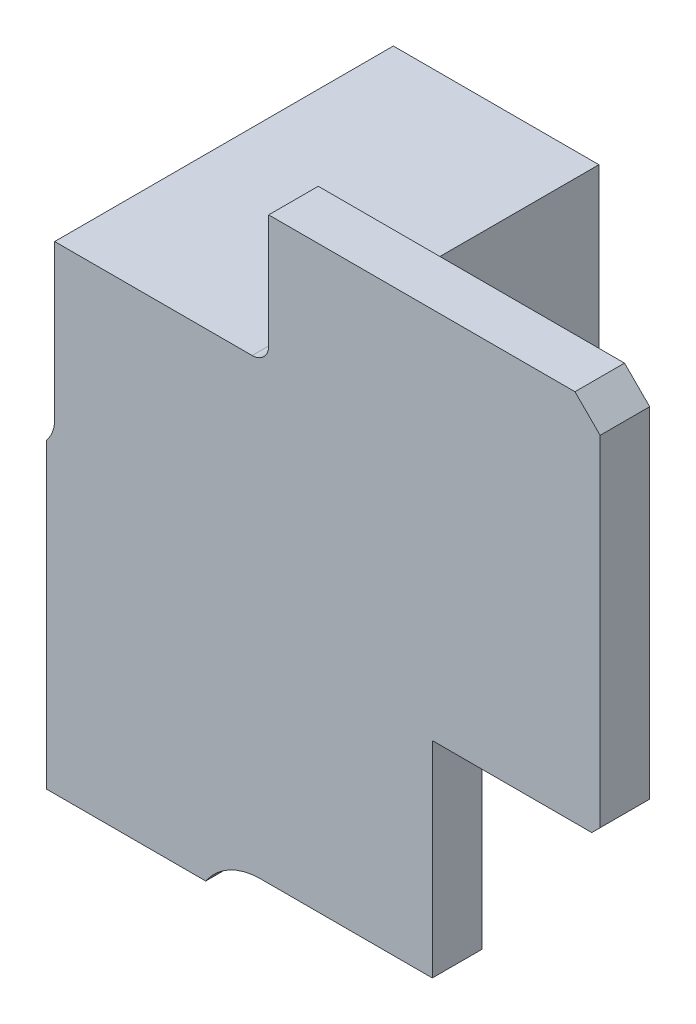
ISO-10303-21;
HEADER;
FILE_DESCRIPTION(('STEP AP214'),'2;1');
FILE_NAME('part.step','',(''),(''),'','','');
FILE_SCHEMA(('AUTOMOTIVE_DESIGN { 1 0 10303 214 1 1 1 1 }'));
ENDSEC;
DATA;
#1=APPLICATION_CONTEXT('core data for automotive mechanical design processes');
#2=APPLICATION_PROTOCOL_DEFINITION('international standard','automotive_design',2000,#1);
#3=PRODUCT_CONTEXT('',#1,'mechanical');
#4=PRODUCT('Part','Part','',(#3));
#5=PRODUCT_RELATED_PRODUCT_CATEGORY('part','',(#4));
#6=PRODUCT_DEFINITION_FORMATION('','',#4);
#7=PRODUCT_DEFINITION_CONTEXT('part definition',#1,'design');
#8=PRODUCT_DEFINITION('design','',#6,#7);
#9=PRODUCT_DEFINITION_SHAPE('','',#8);
#10=(LENGTH_UNIT() NAMED_UNIT(*) SI_UNIT(.MILLI.,.METRE.));
#11=(NAMED_UNIT(*) PLANE_ANGLE_UNIT() SI_UNIT($,.RADIAN.));
#12=(NAMED_UNIT(*) SI_UNIT($,.STERADIAN.) SOLID_ANGLE_UNIT());
#13=UNCERTAINTY_MEASURE_WITH_UNIT(LENGTH_MEASURE(1.E-05),#10,'distance_accuracy_value','');
#14=(GEOMETRIC_REPRESENTATION_CONTEXT(3) GLOBAL_UNCERTAINTY_ASSIGNED_CONTEXT((#13)) GLOBAL_UNIT_ASSIGNED_CONTEXT((#10,
#11,#12)) REPRESENTATION_CONTEXT('',''));
#15=CARTESIAN_POINT('',(0.,0.,0.));
#16=DIRECTION('',(0.,0.,1.));
#17=DIRECTION('',(1.,0.,0.));
#18=AXIS2_PLACEMENT_3D('',#15,#16,#17);
#19=CARTESIAN_POINT('',(0.,0.,0.));
#20=DIRECTION('',(0.,0.,1.));
#21=DIRECTION('',(1.,0.,0.));
#22=AXIS2_PLACEMENT_3D('',#19,#20,#21);
#23=PLANE('',#22);
#24=DIRECTION('',(1.,0.,0.));
#25=VECTOR('',#24,1.);
#26=CARTESIAN_POINT('',(0.,90.424,0.));
#27=LINE('',#26,#25);
#28=CARTESIAN_POINT('',(97.162789,90.424,0.));
#29=VERTEX_POINT('',#28);
#30=CARTESIAN_POINT('',(97.409,90.424,0.));
#31=VERTEX_POINT('',#30);
#32=EDGE_CURVE('E210',#29,#31,#27,.T.);
#33=ORIENTED_EDGE('',*,*,#32,.F.);
#34=CARTESIAN_POINT('',(97.162789,90.924211,0.));
#35=DIRECTION('',(0.,0.,1.));
#36=DIRECTION('',(1.,0.,0.));
#37=AXIS2_PLACEMENT_3D('',#34,#35,#36);
#38=CIRCLE('',#37,0.500211);
#39=CARTESIAN_POINT('',(97.663,90.924211,0.));
#40=VERTEX_POINT('',#39);
#41=EDGE_CURVE('E303',#40,#29,#38,.F.);
#42=ORIENTED_EDGE('',*,*,#41,.F.);
#43=DIRECTION('',(0.,1.,0.));
#44=VECTOR('',#43,1.);
#45=CARTESIAN_POINT('',(97.663,0.,0.));
#46=LINE('',#45,#44);
#47=CARTESIAN_POINT('',(97.663,94.361,0.));
#48=VERTEX_POINT('',#47);
#49=EDGE_CURVE('E252',#40,#48,#46,.T.);
#50=ORIENTED_EDGE('',*,*,#49,.T.);
#51=DIRECTION('',(1.,0.,0.));
#52=VECTOR('',#51,1.);
#53=CARTESIAN_POINT('',(0.,94.361,0.));
#54=LINE('',#53,#52);
#55=CARTESIAN_POINT('',(106.934,94.361,0.));
#56=VERTEX_POINT('',#55);
#57=EDGE_CURVE('E258',#48,#56,#54,.T.);
#58=ORIENTED_EDGE('',*,*,#57,.T.);
#59=DIRECTION('',(0.707106781186548,-0.707106781186548,0.));
#60=VECTOR('',#59,1.);
#61=CARTESIAN_POINT('',(100.6475,100.6475,0.));
#62=LINE('',#61,#60);
#63=CARTESIAN_POINT('',(107.696,93.599,0.));
#64=VERTEX_POINT('',#63);
#65=EDGE_CURVE('E332',#56,#64,#62,.T.);
#66=ORIENTED_EDGE('',*,*,#65,.T.);
#67=DIRECTION('',(0.,1.,0.));
#68=VECTOR('',#67,1.);
#69=CARTESIAN_POINT('',(107.696,0.,0.));
#70=LINE('',#69,#68);
#71=CARTESIAN_POINT('',(107.696,83.312,0.));
#72=VERTEX_POINT('',#71);
#73=EDGE_CURVE('E328',#72,#64,#70,.T.);
#74=ORIENTED_EDGE('',*,*,#73,.F.);
#75=DIRECTION('',(0.707106781186548,0.707106781186548,0.));
#76=VECTOR('',#75,1.);
#77=CARTESIAN_POINT('',(12.192,-12.192,0.));
#78=LINE('',#77,#76);
#79=CARTESIAN_POINT('',(107.442,83.058,0.));
#80=VERTEX_POINT('',#79);
#81=EDGE_CURVE('E325',#80,#72,#78,.T.);
#82=ORIENTED_EDGE('',*,*,#81,.F.);
#83=DIRECTION('',(1.,0.,0.));
#84=VECTOR('',#83,1.);
#85=CARTESIAN_POINT('',(0.,83.058,0.));
#86=LINE('',#85,#84);
#87=CARTESIAN_POINT('',(102.616,83.058,0.));
#88=VERTEX_POINT('',#87);
#89=EDGE_CURVE('E322',#88,#80,#86,.T.);
#90=ORIENTED_EDGE('',*,*,#89,.F.);
#91=DIRECTION('',(0.,-1.,0.));
#92=VECTOR('',#91,1.);
#93=CARTESIAN_POINT('',(102.616,-2.28788405074522E-13,0.));
#94=LINE('',#93,#92);
#95=CARTESIAN_POINT('',(102.616,76.8335452544773,0.));
#96=VERTEX_POINT('',#95);
#97=EDGE_CURVE('E318',#88,#96,#94,.T.);
#98=ORIENTED_EDGE('',*,*,#97,.T.);
#99=DIRECTION('',(1.,0.,0.));
#100=VECTOR('',#99,1.);
#101=CARTESIAN_POINT('',(0.,76.8335452544773,0.));
#102=LINE('',#101,#100);
#103=CARTESIAN_POINT('',(97.420060299497,76.8335452544773,0.));
#104=VERTEX_POINT('',#103);
#105=EDGE_CURVE('E315',#104,#96,#102,.T.);
#106=ORIENTED_EDGE('',*,*,#105,.F.);
#107=CARTESIAN_POINT('',(97.420060299497,74.8335452544773,0.));
#108=DIRECTION('',(0.,0.,1.));
#109=DIRECTION('',(1.,0.,0.));
#110=AXIS2_PLACEMENT_3D('',#107,#108,#109);
#111=CIRCLE('',#110,2.);
#112=CARTESIAN_POINT('',(95.758,75.946,0.));
#113=VERTEX_POINT('',#112);
#114=EDGE_CURVE('E50',#104,#113,#111,.T.);
#115=ORIENTED_EDGE('',*,*,#114,.T.);
#116=DIRECTION('',(1.,0.,0.));
#117=VECTOR('',#116,1.);
#118=CARTESIAN_POINT('',(0.,75.946,0.));
#119=LINE('',#118,#117);
#120=CARTESIAN_POINT('',(95.25,75.946,0.));
#121=VERTEX_POINT('',#120);
#122=EDGE_CURVE('E311',#121,#113,#119,.T.);
#123=ORIENTED_EDGE('',*,*,#122,.F.);
#124=DIRECTION('',(0.,-1.,0.));
#125=VECTOR('',#124,1.);
#126=CARTESIAN_POINT('',(95.25,0.,0.));
#127=LINE('',#126,#125);
#128=CARTESIAN_POINT('',(95.25,81.28,0.));
#129=VERTEX_POINT('',#128);
#130=EDGE_CURVE('E212',#129,#121,#127,.T.);
#131=ORIENTED_EDGE('',*,*,#130,.F.);
#132=DIRECTION('',(1.,0.,0.));
#133=VECTOR('',#132,1.);
#134=CARTESIAN_POINT('',(0.,81.28,0.));
#135=LINE('',#134,#133);
#136=CARTESIAN_POINT('',(90.932,81.28,0.));
#137=VERTEX_POINT('',#136);
#138=EDGE_CURVE('E217',#137,#129,#135,.T.);
#139=ORIENTED_EDGE('',*,*,#138,.F.);
#140=DIRECTION('',(0.,1.,0.));
#141=VECTOR('',#140,1.);
#142=CARTESIAN_POINT('',(90.932,0.,0.));
#143=LINE('',#142,#141);
#144=CARTESIAN_POINT('',(90.932,85.09,0.));
#145=VERTEX_POINT('',#144);
#146=EDGE_CURVE('E307',#137,#145,#143,.T.);
#147=ORIENTED_EDGE('',*,*,#146,.T.);
#148=CARTESIAN_POINT('',(90.186,85.7559459437522,0.));
#149=DIRECTION('',(0.,0.,1.));
#150=DIRECTION('',(1.,0.,0.));
#151=AXIS2_PLACEMENT_3D('',#148,#149,#150);
#152=CIRCLE('',#151,1.);
#153=CARTESIAN_POINT('',(91.186,85.7559459437522,0.));
#154=VERTEX_POINT('',#153);
#155=EDGE_CURVE('E388',#145,#154,#152,.T.);
#156=ORIENTED_EDGE('',*,*,#155,.T.);
#157=DIRECTION('',(0.,1.,0.));
#158=VECTOR('',#157,1.);
#159=CARTESIAN_POINT('',(91.186,0.,0.));
#160=LINE('',#159,#158);
#161=CARTESIAN_POINT('',(91.186,85.344,0.));
#162=VERTEX_POINT('',#161);
#163=EDGE_CURVE('E384',#162,#154,#160,.T.);
#164=ORIENTED_EDGE('',*,*,#163,.F.);
#165=DIRECTION('',(-1.,0.,0.));
#166=VECTOR('',#165,1.);
#167=CARTESIAN_POINT('',(0.,85.344,0.));
#168=LINE('',#167,#166);
#169=CARTESIAN_POINT('',(97.409,85.344,0.));
#170=VERTEX_POINT('',#169);
#171=EDGE_CURVE('E205',#170,#162,#168,.T.);
#172=ORIENTED_EDGE('',*,*,#171,.F.);
#173=DIRECTION('',(0.,-1.,0.));
#174=VECTOR('',#173,1.);
#175=CARTESIAN_POINT('',(97.409,0.,0.));
#176=LINE('',#175,#174);
#177=EDGE_CURVE('E475',#31,#170,#176,.T.);
#178=ORIENTED_EDGE('',*,*,#177,.F.);
#179=EDGE_LOOP('',(#33,#42,#50,#58,#66,#74,#82,#90,#98,#106,#115,#123,#131,#139,#147,#156,#164,
#172,#178));
#180=FACE_BOUND('',#179,.T.);
#181=ADVANCED_FACE('F41',(#180),#23,.F.);
#182=CARTESIAN_POINT('',(97.663,0.,1.5));
#183=DIRECTION('',(-1.,0.,0.));
#184=DIRECTION('',(0.,0.,1.));
#185=AXIS2_PLACEMENT_3D('',#182,#183,#184);
#186=PLANE('',#185);
#187=ORIENTED_EDGE('',*,*,#49,.F.);
#188=DIRECTION('',(0.,0.,-1.));
#189=VECTOR('',#188,1.);
#190=CARTESIAN_POINT('',(97.663,90.924211,1.5));
#191=LINE('',#190,#189);
#192=CARTESIAN_POINT('',(97.663,90.924211,1.5));
#193=VERTEX_POINT('',#192);
#194=EDGE_CURVE('E378',#193,#40,#191,.T.);
#195=ORIENTED_EDGE('',*,*,#194,.F.);
#196=DIRECTION('',(0.,1.,0.));
#197=VECTOR('',#196,1.);
#198=CARTESIAN_POINT('',(97.663,0.,1.5));
#199=LINE('',#198,#197);
#200=CARTESIAN_POINT('',(97.663,94.361,1.5));
#201=VERTEX_POINT('',#200);
#202=EDGE_CURVE('E253',#193,#201,#199,.T.);
#203=ORIENTED_EDGE('',*,*,#202,.T.);
#204=DIRECTION('',(0.,0.,-1.));
#205=VECTOR('',#204,1.);
#206=CARTESIAN_POINT('',(97.663,94.361,1.5));
#207=LINE('',#206,#205);
#208=EDGE_CURVE('E299',#201,#48,#207,.T.);
#209=ORIENTED_EDGE('',*,*,#208,.T.);
#210=EDGE_LOOP('',(#187,#195,#203,#209));
#211=FACE_BOUND('',#210,.T.);
#212=ADVANCED_FACE('F440',(#211),#186,.T.);
#213=CARTESIAN_POINT('',(97.162789,90.924211,1.5));
#214=DIRECTION('',(0.,0.,-1.));
#215=DIRECTION('',(-1.,0.,0.));
#216=AXIS2_PLACEMENT_3D('',#213,#214,#215);
#217=CYLINDRICAL_SURFACE('',#216,0.500211);
#218=ORIENTED_EDGE('',*,*,#41,.T.);
#219=DIRECTION('',(0.,0.,-1.));
#220=VECTOR('',#219,1.);
#221=CARTESIAN_POINT('',(97.162789,90.424,1.5));
#222=LINE('',#221,#220);
#223=CARTESIAN_POINT('',(97.162789,90.424,1.5));
#224=VERTEX_POINT('',#223);
#225=EDGE_CURVE('E375',#224,#29,#222,.T.);
#226=ORIENTED_EDGE('',*,*,#225,.F.);
#227=CARTESIAN_POINT('',(97.162789,90.924211,1.5));
#228=DIRECTION('',(0.,0.,1.));
#229=DIRECTION('',(1.,0.,0.));
#230=AXIS2_PLACEMENT_3D('',#227,#228,#229);
#231=CIRCLE('',#230,0.500211);
#232=EDGE_CURVE('E257',#193,#224,#231,.F.);
#233=ORIENTED_EDGE('',*,*,#232,.F.);
#234=ORIENTED_EDGE('',*,*,#194,.T.);
#235=EDGE_LOOP('',(#218,#226,#233,#234));
#236=FACE_BOUND('',#235,.T.);
#237=ADVANCED_FACE('F443',(#236),#217,.F.);
#238=CARTESIAN_POINT('',(0.,90.424,1.5));
#239=DIRECTION('',(0.,-1.,0.));
#240=DIRECTION('',(0.,0.,-1.));
#241=AXIS2_PLACEMENT_3D('',#238,#239,#240);
#242=PLANE('',#241);
#243=ORIENTED_EDGE('',*,*,#225,.T.);
#244=ORIENTED_EDGE('',*,*,#32,.T.);
#245=DIRECTION('',(0.,0.,1.));
#246=VECTOR('',#245,1.);
#247=CARTESIAN_POINT('',(97.409,90.424,-8.75));
#248=LINE('',#247,#246);
#249=CARTESIAN_POINT('',(97.409,90.424,-8.75));
#250=VERTEX_POINT('',#249);
#251=EDGE_CURVE('E188',#250,#31,#248,.T.);
#252=ORIENTED_EDGE('',*,*,#251,.F.);
#253=DIRECTION('',(1.,0.,0.));
#254=VECTOR('',#253,1.);
#255=CARTESIAN_POINT('',(0.,90.424,-8.75));
#256=LINE('',#255,#254);
#257=CARTESIAN_POINT('',(91.186,90.424,-8.75));
#258=VERTEX_POINT('',#257);
#259=EDGE_CURVE('E195',#258,#250,#256,.T.);
#260=ORIENTED_EDGE('',*,*,#259,.F.);
#261=DIRECTION('',(0.,0.,-1.));
#262=VECTOR('',#261,1.);
#263=CARTESIAN_POINT('',(91.186,90.424,1.5));
#264=LINE('',#263,#262);
#265=CARTESIAN_POINT('',(91.186,90.424,1.5));
#266=VERTEX_POINT('',#265);
#267=EDGE_CURVE('E372',#266,#258,#264,.T.);
#268=ORIENTED_EDGE('',*,*,#267,.F.);
#269=DIRECTION('',(-1.,0.,0.));
#270=VECTOR('',#269,1.);
#271=CARTESIAN_POINT('',(0.,90.424,1.5));
#272=LINE('',#271,#270);
#273=EDGE_CURVE('E261',#224,#266,#272,.T.);
#274=ORIENTED_EDGE('',*,*,#273,.F.);
#275=EDGE_LOOP('',(#243,#244,#252,#260,#268,#274));
#276=FACE_BOUND('',#275,.T.);
#277=ADVANCED_FACE('F209',(#276),#242,.F.);
#278=CARTESIAN_POINT('',(91.186,0.,1.5));
#279=DIRECTION('',(-1.,0.,0.));
#280=DIRECTION('',(0.,0.,1.));
#281=AXIS2_PLACEMENT_3D('',#278,#279,#280);
#282=PLANE('',#281);
#283=DIRECTION('',(0.,0.,1.));
#284=VECTOR('',#283,1.);
#285=CARTESIAN_POINT('',(91.186,85.344,-8.75));
#286=LINE('',#285,#284);
#287=CARTESIAN_POINT('',(91.186,85.344,-8.75));
#288=VERTEX_POINT('',#287);
#289=EDGE_CURVE('E219',#288,#162,#286,.T.);
#290=ORIENTED_EDGE('',*,*,#289,.T.);
#291=ORIENTED_EDGE('',*,*,#163,.T.);
#292=DIRECTION('',(0.,0.,-1.));
#293=VECTOR('',#292,1.);
#294=CARTESIAN_POINT('',(91.186,85.7559459437522,1.5));
#295=LINE('',#294,#293);
#296=CARTESIAN_POINT('',(91.186,85.7559459437522,1.5));
#297=VERTEX_POINT('',#296);
#298=EDGE_CURVE('E381',#154,#297,#295,.F.);
#299=ORIENTED_EDGE('',*,*,#298,.T.);
#300=DIRECTION('',(0.,1.,0.));
#301=VECTOR('',#300,1.);
#302=CARTESIAN_POINT('',(91.186,0.,1.5));
#303=LINE('',#302,#301);
#304=EDGE_CURVE('E265',#297,#266,#303,.T.);
#305=ORIENTED_EDGE('',*,*,#304,.T.);
#306=ORIENTED_EDGE('',*,*,#267,.T.);
#307=DIRECTION('',(0.,1.,0.));
#308=VECTOR('',#307,1.);
#309=CARTESIAN_POINT('',(91.186,0.,-8.75));
#310=LINE('',#309,#308);
#311=EDGE_CURVE('E201',#288,#258,#310,.T.);
#312=ORIENTED_EDGE('',*,*,#311,.F.);
#313=EDGE_LOOP('',(#290,#291,#299,#305,#306,#312));
#314=FACE_BOUND('',#313,.T.);
#315=ADVANCED_FACE('F468',(#314),#282,.T.);
#316=CARTESIAN_POINT('',(90.932,0.,1.5));
#317=DIRECTION('',(-1.,0.,0.));
#318=DIRECTION('',(0.,0.,1.));
#319=AXIS2_PLACEMENT_3D('',#316,#317,#318);
#320=PLANE('',#319);
#321=ORIENTED_EDGE('',*,*,#146,.F.);
#322=DIRECTION('',(0.,0.,1.));
#323=VECTOR('',#322,1.);
#324=CARTESIAN_POINT('',(90.932,81.28,-1.5));
#325=LINE('',#324,#323);
#326=CARTESIAN_POINT('',(90.932,81.28,-1.5));
#327=VERTEX_POINT('',#326);
#328=EDGE_CURVE('E244',#327,#137,#325,.T.);
#329=ORIENTED_EDGE('',*,*,#328,.F.);
#330=DIRECTION('',(0.,1.,0.));
#331=VECTOR('',#330,1.);
#332=CARTESIAN_POINT('',(90.932,0.,-1.5));
#333=LINE('',#332,#331);
#334=CARTESIAN_POINT('',(90.932,75.946,-1.5));
#335=VERTEX_POINT('',#334);
#336=EDGE_CURVE('E231',#335,#327,#333,.T.);
#337=ORIENTED_EDGE('',*,*,#336,.F.);
#338=DIRECTION('',(0.,0.,-1.));
#339=VECTOR('',#338,1.);
#340=CARTESIAN_POINT('',(90.932,75.946,1.5));
#341=LINE('',#340,#339);
#342=CARTESIAN_POINT('',(90.932,75.946,1.5));
#343=VERTEX_POINT('',#342);
#344=EDGE_CURVE('E365',#343,#335,#341,.T.);
#345=ORIENTED_EDGE('',*,*,#344,.F.);
#346=DIRECTION('',(0.,1.,0.));
#347=VECTOR('',#346,1.);
#348=CARTESIAN_POINT('',(90.932,0.,1.5));
#349=LINE('',#348,#347);
#350=CARTESIAN_POINT('',(90.932,85.09,1.5));
#351=VERTEX_POINT('',#350);
#352=EDGE_CURVE('E268',#343,#351,#349,.T.);
#353=ORIENTED_EDGE('',*,*,#352,.T.);
#354=DIRECTION('',(0.,0.,-1.));
#355=VECTOR('',#354,1.);
#356=CARTESIAN_POINT('',(90.932,85.09,1.5));
#357=LINE('',#356,#355);
#358=EDGE_CURVE('E368',#351,#145,#357,.T.);
#359=ORIENTED_EDGE('',*,*,#358,.T.);
#360=EDGE_LOOP('',(#321,#329,#337,#345,#353,#359));
#361=FACE_BOUND('',#360,.T.);
#362=ADVANCED_FACE('F455',(#361),#320,.T.);
#363=CARTESIAN_POINT('',(0.,75.946,1.5));
#364=DIRECTION('',(0.,1.,0.));
#365=DIRECTION('',(0.,0.,1.));
#366=AXIS2_PLACEMENT_3D('',#363,#364,#365);
#367=PLANE('',#366);
#368=ORIENTED_EDGE('',*,*,#344,.T.);
#369=DIRECTION('',(-1.,0.,0.));
#370=VECTOR('',#369,1.);
#371=CARTESIAN_POINT('',(0.,75.946,-1.5));
#372=LINE('',#371,#370);
#373=CARTESIAN_POINT('',(95.25,75.946,-1.5));
#374=VERTEX_POINT('',#373);
#375=EDGE_CURVE('E227',#374,#335,#372,.T.);
#376=ORIENTED_EDGE('',*,*,#375,.F.);
#377=DIRECTION('',(0.,0.,1.));
#378=VECTOR('',#377,1.);
#379=CARTESIAN_POINT('',(95.25,75.946,-1.5));
#380=LINE('',#379,#378);
#381=EDGE_CURVE('E248',#374,#121,#380,.T.);
#382=ORIENTED_EDGE('',*,*,#381,.T.);
#383=ORIENTED_EDGE('',*,*,#122,.T.);
#384=DIRECTION('',(0.,0.,-1.));
#385=VECTOR('',#384,1.);
#386=CARTESIAN_POINT('',(95.758,75.946,1.5));
#387=LINE('',#386,#385);
#388=CARTESIAN_POINT('',(95.758,75.946,1.5));
#389=VERTEX_POINT('',#388);
#390=EDGE_CURVE('E362',#389,#113,#387,.T.);
#391=ORIENTED_EDGE('',*,*,#390,.F.);
#392=DIRECTION('',(1.,0.,0.));
#393=VECTOR('',#392,1.);
#394=CARTESIAN_POINT('',(0.,75.946,1.5));
#395=LINE('',#394,#393);
#396=EDGE_CURVE('E272',#343,#389,#395,.T.);
#397=ORIENTED_EDGE('',*,*,#396,.F.);
#398=EDGE_LOOP('',(#368,#376,#382,#383,#391,#397));
#399=FACE_BOUND('',#398,.T.);
#400=ADVANCED_FACE('F401',(#399),#367,.F.);
#401=CARTESIAN_POINT('',(0.,76.8335452544773,1.5));
#402=DIRECTION('',(0.,1.,0.));
#403=DIRECTION('',(0.,0.,1.));
#404=AXIS2_PLACEMENT_3D('',#401,#402,#403);
#405=PLANE('',#404);
#406=DIRECTION('',(1.,0.,0.));
#407=VECTOR('',#406,1.);
#408=CARTESIAN_POINT('',(0.,76.8335452544773,1.5));
#409=LINE('',#408,#407);
#410=CARTESIAN_POINT('',(97.420060299497,76.8335452544773,1.5));
#411=VERTEX_POINT('',#410);
#412=CARTESIAN_POINT('',(102.616,76.8335452544773,1.5));
#413=VERTEX_POINT('',#412);
#414=EDGE_CURVE('E275',#411,#413,#409,.T.);
#415=ORIENTED_EDGE('',*,*,#414,.F.);
#416=DIRECTION('',(0.,0.,1.));
#417=VECTOR('',#416,1.);
#418=CARTESIAN_POINT('',(97.420060299497,76.8335452544773,1.5));
#419=LINE('',#418,#417);
#420=EDGE_CURVE('E394',#411,#104,#419,.F.);
#421=ORIENTED_EDGE('',*,*,#420,.T.);
#422=ORIENTED_EDGE('',*,*,#105,.T.);
#423=DIRECTION('',(0.,0.,-1.));
#424=VECTOR('',#423,1.);
#425=CARTESIAN_POINT('',(102.616,76.8335452544773,1.5));
#426=LINE('',#425,#424);
#427=EDGE_CURVE('E358',#413,#96,#426,.T.);
#428=ORIENTED_EDGE('',*,*,#427,.F.);
#429=EDGE_LOOP('',(#415,#421,#422,#428));
#430=FACE_BOUND('',#429,.T.);
#431=ADVANCED_FACE('F405',(#430),#405,.F.);
#432=CARTESIAN_POINT('',(102.616,-2.28788405074522E-13,1.5));
#433=DIRECTION('',(1.,0.,0.));
#434=DIRECTION('',(0.,1.,0.));
#435=AXIS2_PLACEMENT_3D('',#432,#433,#434);
#436=PLANE('',#435);
#437=ORIENTED_EDGE('',*,*,#97,.F.);
#438=DIRECTION('',(0.,0.,-1.));
#439=VECTOR('',#438,1.);
#440=CARTESIAN_POINT('',(102.616,83.058,1.5));
#441=LINE('',#440,#439);
#442=CARTESIAN_POINT('',(102.616,83.058,1.5));
#443=VERTEX_POINT('',#442);
#444=EDGE_CURVE('E355',#443,#88,#441,.T.);
#445=ORIENTED_EDGE('',*,*,#444,.F.);
#446=DIRECTION('',(0.,-1.,0.));
#447=VECTOR('',#446,1.);
#448=CARTESIAN_POINT('',(102.616,-2.28788405074522E-13,1.5));
#449=LINE('',#448,#447);
#450=EDGE_CURVE('E278',#443,#413,#449,.T.);
#451=ORIENTED_EDGE('',*,*,#450,.T.);
#452=ORIENTED_EDGE('',*,*,#427,.T.);
#453=EDGE_LOOP('',(#437,#445,#451,#452));
#454=FACE_BOUND('',#453,.T.);
#455=ADVANCED_FACE('F414',(#454),#436,.T.);
#456=CARTESIAN_POINT('',(0.,83.058,1.5));
#457=DIRECTION('',(0.,1.,0.));
#458=DIRECTION('',(0.,0.,1.));
#459=AXIS2_PLACEMENT_3D('',#456,#457,#458);
#460=PLANE('',#459);
#461=ORIENTED_EDGE('',*,*,#89,.T.);
#462=DIRECTION('',(0.,0.,-1.));
#463=VECTOR('',#462,1.);
#464=CARTESIAN_POINT('',(107.442,83.058,1.5));
#465=LINE('',#464,#463);
#466=CARTESIAN_POINT('',(107.442,83.058,1.5));
#467=VERTEX_POINT('',#466);
#468=EDGE_CURVE('E351',#467,#80,#465,.T.);
#469=ORIENTED_EDGE('',*,*,#468,.F.);
#470=DIRECTION('',(1.,0.,0.));
#471=VECTOR('',#470,1.);
#472=CARTESIAN_POINT('',(0.,83.058,1.5));
#473=LINE('',#472,#471);
#474=EDGE_CURVE('E282',#443,#467,#473,.T.);
#475=ORIENTED_EDGE('',*,*,#474,.F.);
#476=ORIENTED_EDGE('',*,*,#444,.T.);
#477=EDGE_LOOP('',(#461,#469,#475,#476));
#478=FACE_BOUND('',#477,.T.);
#479=ADVANCED_FACE('F417',(#478),#460,.F.);
#480=CARTESIAN_POINT('',(12.192,-12.192,1.5));
#481=DIRECTION('',(-0.707106781186547,0.707106781186547,0.));
#482=DIRECTION('',(-0.707106781186548,-0.707106781186548,0.));
#483=AXIS2_PLACEMENT_3D('',#480,#481,#482);
#484=PLANE('',#483);
#485=ORIENTED_EDGE('',*,*,#81,.T.);
#486=DIRECTION('',(0.,0.,-1.));
#487=VECTOR('',#486,1.);
#488=CARTESIAN_POINT('',(107.696,83.312,1.5));
#489=LINE('',#488,#487);
#490=CARTESIAN_POINT('',(107.696,83.312,1.5));
#491=VERTEX_POINT('',#490);
#492=EDGE_CURVE('E347',#491,#72,#489,.T.);
#493=ORIENTED_EDGE('',*,*,#492,.F.);
#494=DIRECTION('',(0.707106781186548,0.707106781186548,0.));
#495=VECTOR('',#494,1.);
#496=CARTESIAN_POINT('',(12.192,-12.192,1.5));
#497=LINE('',#496,#495);
#498=EDGE_CURVE('E285',#467,#491,#497,.T.);
#499=ORIENTED_EDGE('',*,*,#498,.F.);
#500=ORIENTED_EDGE('',*,*,#468,.T.);
#501=EDGE_LOOP('',(#485,#493,#499,#500));
#502=FACE_BOUND('',#501,.T.);
#503=ADVANCED_FACE('F422',(#502),#484,.F.);
#504=CARTESIAN_POINT('',(107.696,0.,1.5));
#505=DIRECTION('',(-1.,0.,0.));
#506=DIRECTION('',(0.,0.,1.));
#507=AXIS2_PLACEMENT_3D('',#504,#505,#506);
#508=PLANE('',#507);
#509=ORIENTED_EDGE('',*,*,#73,.T.);
#510=DIRECTION('',(0.,0.,-1.));
#511=VECTOR('',#510,1.);
#512=CARTESIAN_POINT('',(107.696,93.599,1.5));
#513=LINE('',#512,#511);
#514=CARTESIAN_POINT('',(107.696,93.599,1.5));
#515=VERTEX_POINT('',#514);
#516=EDGE_CURVE('E344',#515,#64,#513,.T.);
#517=ORIENTED_EDGE('',*,*,#516,.F.);
#518=DIRECTION('',(0.,1.,0.));
#519=VECTOR('',#518,1.);
#520=CARTESIAN_POINT('',(107.696,0.,1.5));
#521=LINE('',#520,#519);
#522=EDGE_CURVE('E288',#491,#515,#521,.T.);
#523=ORIENTED_EDGE('',*,*,#522,.F.);
#524=ORIENTED_EDGE('',*,*,#492,.T.);
#525=EDGE_LOOP('',(#509,#517,#523,#524));
#526=FACE_BOUND('',#525,.T.);
#527=ADVANCED_FACE('F428',(#526),#508,.F.);
#528=CARTESIAN_POINT('',(100.6475,100.6475,1.5));
#529=DIRECTION('',(0.707106781186547,0.707106781186547,0.));
#530=DIRECTION('',(-0.707106781186548,0.707106781186548,0.));
#531=AXIS2_PLACEMENT_3D('',#528,#529,#530);
#532=PLANE('',#531);
#533=ORIENTED_EDGE('',*,*,#65,.F.);
#534=DIRECTION('',(0.,0.,-1.));
#535=VECTOR('',#534,1.);
#536=CARTESIAN_POINT('',(106.934,94.361,1.5));
#537=LINE('',#536,#535);
#538=CARTESIAN_POINT('',(106.934,94.361,1.5));
#539=VERTEX_POINT('',#538);
#540=EDGE_CURVE('E341',#539,#56,#537,.T.);
#541=ORIENTED_EDGE('',*,*,#540,.F.);
#542=DIRECTION('',(0.707106781186548,-0.707106781186548,0.));
#543=VECTOR('',#542,1.);
#544=CARTESIAN_POINT('',(100.6475,100.6475,1.5));
#545=LINE('',#544,#543);
#546=EDGE_CURVE('E291',#539,#515,#545,.T.);
#547=ORIENTED_EDGE('',*,*,#546,.T.);
#548=ORIENTED_EDGE('',*,*,#516,.T.);
#549=EDGE_LOOP('',(#533,#541,#547,#548));
#550=FACE_BOUND('',#549,.T.);
#551=ADVANCED_FACE('F432',(#550),#532,.T.);
#552=CARTESIAN_POINT('',(0.,94.361,1.5));
#553=DIRECTION('',(0.,1.,0.));
#554=DIRECTION('',(0.,0.,1.));
#555=AXIS2_PLACEMENT_3D('',#552,#553,#554);
#556=PLANE('',#555);
#557=ORIENTED_EDGE('',*,*,#57,.F.);
#558=ORIENTED_EDGE('',*,*,#208,.F.);
#559=DIRECTION('',(1.,0.,0.));
#560=VECTOR('',#559,1.);
#561=CARTESIAN_POINT('',(0.,94.361,1.5));
#562=LINE('',#561,#560);
#563=EDGE_CURVE('E295',#201,#539,#562,.T.);
#564=ORIENTED_EDGE('',*,*,#563,.T.);
#565=ORIENTED_EDGE('',*,*,#540,.T.);
#566=EDGE_LOOP('',(#557,#558,#564,#565));
#567=FACE_BOUND('',#566,.T.);
#568=ADVANCED_FACE('F435',(#567),#556,.T.);
#569=CARTESIAN_POINT('',(0.,0.,1.5));
#570=DIRECTION('',(0.,0.,1.));
#571=DIRECTION('',(1.,0.,0.));
#572=AXIS2_PLACEMENT_3D('',#569,#570,#571);
#573=PLANE('',#572);
#574=ORIENTED_EDGE('',*,*,#202,.F.);
#575=ORIENTED_EDGE('',*,*,#232,.T.);
#576=ORIENTED_EDGE('',*,*,#273,.T.);
#577=ORIENTED_EDGE('',*,*,#304,.F.);
#578=CARTESIAN_POINT('',(90.186,85.7559459437522,1.5));
#579=DIRECTION('',(0.,0.,1.));
#580=DIRECTION('',(1.,0.,0.));
#581=AXIS2_PLACEMENT_3D('',#578,#579,#580);
#582=CIRCLE('',#581,1.);
#583=EDGE_CURVE('E391',#297,#351,#582,.F.);
#584=ORIENTED_EDGE('',*,*,#583,.T.);
#585=ORIENTED_EDGE('',*,*,#352,.F.);
#586=ORIENTED_EDGE('',*,*,#396,.T.);
#587=CARTESIAN_POINT('',(97.420060299497,74.8335452544773,1.5));
#588=DIRECTION('',(0.,0.,1.));
#589=DIRECTION('',(1.,0.,0.));
#590=AXIS2_PLACEMENT_3D('',#587,#588,#589);
#591=CIRCLE('',#590,2.);
#592=EDGE_CURVE('E11',#389,#411,#591,.F.);
#593=ORIENTED_EDGE('',*,*,#592,.T.);
#594=ORIENTED_EDGE('',*,*,#414,.T.);
#595=ORIENTED_EDGE('',*,*,#450,.F.);
#596=ORIENTED_EDGE('',*,*,#474,.T.);
#597=ORIENTED_EDGE('',*,*,#498,.T.);
#598=ORIENTED_EDGE('',*,*,#522,.T.);
#599=ORIENTED_EDGE('',*,*,#546,.F.);
#600=ORIENTED_EDGE('',*,*,#563,.F.);
#601=EDGE_LOOP('',(#574,#575,#576,#577,#584,#585,#586,#593,#594,#595,#596,#597,#598,#599,#600));
#602=FACE_BOUND('',#601,.T.);
#603=ADVANCED_FACE('F409',(#602),#573,.T.);
#604=CARTESIAN_POINT('',(95.25,0.,-1.5));
#605=DIRECTION('',(-1.,0.,0.));
#606=DIRECTION('',(0.,0.,1.));
#607=AXIS2_PLACEMENT_3D('',#604,#605,#606);
#608=PLANE('',#607);
#609=ORIENTED_EDGE('',*,*,#130,.T.);
#610=ORIENTED_EDGE('',*,*,#381,.F.);
#611=DIRECTION('',(0.,-1.,0.));
#612=VECTOR('',#611,1.);
#613=CARTESIAN_POINT('',(95.25,0.,-1.5));
#614=LINE('',#613,#612);
#615=CARTESIAN_POINT('',(95.25,81.28,-1.5));
#616=VERTEX_POINT('',#615);
#617=EDGE_CURVE('E223',#616,#374,#614,.T.);
#618=ORIENTED_EDGE('',*,*,#617,.F.);
#619=DIRECTION('',(0.,0.,1.));
#620=VECTOR('',#619,1.);
#621=CARTESIAN_POINT('',(95.25,81.28,-1.5));
#622=LINE('',#621,#620);
#623=EDGE_CURVE('E236',#616,#129,#622,.T.);
#624=ORIENTED_EDGE('',*,*,#623,.T.);
#625=EDGE_LOOP('',(#609,#610,#618,#624));
#626=FACE_BOUND('',#625,.T.);
#627=ADVANCED_FACE('F466',(#626),#608,.F.);
#628=CARTESIAN_POINT('',(0.,81.28,-1.5));
#629=DIRECTION('',(0.,-1.,0.));
#630=DIRECTION('',(0.,0.,-1.));
#631=AXIS2_PLACEMENT_3D('',#628,#629,#630);
#632=PLANE('',#631);
#633=ORIENTED_EDGE('',*,*,#138,.T.);
#634=ORIENTED_EDGE('',*,*,#623,.F.);
#635=DIRECTION('',(1.,0.,0.));
#636=VECTOR('',#635,1.);
#637=CARTESIAN_POINT('',(0.,81.28,-1.5));
#638=LINE('',#637,#636);
#639=EDGE_CURVE('E234',#327,#616,#638,.T.);
#640=ORIENTED_EDGE('',*,*,#639,.F.);
#641=ORIENTED_EDGE('',*,*,#328,.T.);
#642=EDGE_LOOP('',(#633,#634,#640,#641));
#643=FACE_BOUND('',#642,.T.);
#644=ADVANCED_FACE('F464',(#643),#632,.F.);
#645=CARTESIAN_POINT('',(0.,0.,-1.5));
#646=DIRECTION('',(0.,0.,-1.));
#647=DIRECTION('',(-1.,0.,0.));
#648=AXIS2_PLACEMENT_3D('',#645,#646,#647);
#649=PLANE('',#648);
#650=ORIENTED_EDGE('',*,*,#617,.T.);
#651=ORIENTED_EDGE('',*,*,#375,.T.);
#652=ORIENTED_EDGE('',*,*,#336,.T.);
#653=ORIENTED_EDGE('',*,*,#639,.T.);
#654=EDGE_LOOP('',(#650,#651,#652,#653));
#655=FACE_BOUND('',#654,.T.);
#656=ADVANCED_FACE('F459',(#655),#649,.T.);
#657=CARTESIAN_POINT('',(97.409,0.,-8.75));
#658=DIRECTION('',(-1.,0.,0.));
#659=DIRECTION('',(0.,0.,1.));
#660=AXIS2_PLACEMENT_3D('',#657,#658,#659);
#661=PLANE('',#660);
#662=ORIENTED_EDGE('',*,*,#177,.T.);
#663=DIRECTION('',(0.,0.,1.));
#664=VECTOR('',#663,1.);
#665=CARTESIAN_POINT('',(97.409,85.344,-8.75));
#666=LINE('',#665,#664);
#667=CARTESIAN_POINT('',(97.409,85.344,-8.75));
#668=VERTEX_POINT('',#667);
#669=EDGE_CURVE('E190',#668,#170,#666,.T.);
#670=ORIENTED_EDGE('',*,*,#669,.F.);
#671=DIRECTION('',(0.,-1.,0.));
#672=VECTOR('',#671,1.);
#673=CARTESIAN_POINT('',(97.409,0.,-8.75));
#674=LINE('',#673,#672);
#675=EDGE_CURVE('E183',#250,#668,#674,.T.);
#676=ORIENTED_EDGE('',*,*,#675,.F.);
#677=ORIENTED_EDGE('',*,*,#251,.T.);
#678=EDGE_LOOP('',(#662,#670,#676,#677));
#679=FACE_BOUND('',#678,.T.);
#680=ADVANCED_FACE('F186',(#679),#661,.F.);
#681=CARTESIAN_POINT('',(0.,85.344,-8.75));
#682=DIRECTION('',(0.,1.,0.));
#683=DIRECTION('',(0.,0.,1.));
#684=AXIS2_PLACEMENT_3D('',#681,#682,#683);
#685=PLANE('',#684);
#686=ORIENTED_EDGE('',*,*,#171,.T.);
#687=ORIENTED_EDGE('',*,*,#289,.F.);
#688=DIRECTION('',(-1.,0.,0.));
#689=VECTOR('',#688,1.);
#690=CARTESIAN_POINT('',(0.,85.344,-8.75));
#691=LINE('',#690,#689);
#692=EDGE_CURVE('E194',#668,#288,#691,.T.);
#693=ORIENTED_EDGE('',*,*,#692,.F.);
#694=ORIENTED_EDGE('',*,*,#669,.T.);
#695=EDGE_LOOP('',(#686,#687,#693,#694));
#696=FACE_BOUND('',#695,.T.);
#697=ADVANCED_FACE('F473',(#696),#685,.F.);
#698=CARTESIAN_POINT('',(0.,0.,-8.75));
#699=DIRECTION('',(0.,0.,-1.));
#700=DIRECTION('',(-1.,0.,0.));
#701=AXIS2_PLACEMENT_3D('',#698,#699,#700);
#702=PLANE('',#701);
#703=ORIENTED_EDGE('',*,*,#259,.T.);
#704=ORIENTED_EDGE('',*,*,#675,.T.);
#705=ORIENTED_EDGE('',*,*,#692,.T.);
#706=ORIENTED_EDGE('',*,*,#311,.T.);
#707=EDGE_LOOP('',(#703,#704,#705,#706));
#708=FACE_BOUND('',#707,.T.);
#709=ADVANCED_FACE('F199',(#708),#702,.T.);
#710=CARTESIAN_POINT('',(90.186,85.7559459437522,1.5));
#711=DIRECTION('',(0.,0.,1.));
#712=DIRECTION('',(1.,0.,0.));
#713=AXIS2_PLACEMENT_3D('',#710,#711,#712);
#714=CYLINDRICAL_SURFACE('',#713,1.);
#715=ORIENTED_EDGE('',*,*,#583,.F.);
#716=ORIENTED_EDGE('',*,*,#298,.F.);
#717=ORIENTED_EDGE('',*,*,#155,.F.);
#718=ORIENTED_EDGE('',*,*,#358,.F.);
#719=EDGE_LOOP('',(#715,#716,#717,#718));
#720=FACE_BOUND('',#719,.T.);
#721=ADVANCED_FACE('F452',(#720),#714,.F.);
#722=CARTESIAN_POINT('',(97.420060299497,74.8335452544773,1.5));
#723=DIRECTION('',(0.,0.,1.));
#724=DIRECTION('',(1.,0.,0.));
#725=AXIS2_PLACEMENT_3D('',#722,#723,#724);
#726=CYLINDRICAL_SURFACE('',#725,2.);
#727=ORIENTED_EDGE('',*,*,#592,.F.);
#728=ORIENTED_EDGE('',*,*,#390,.T.);
#729=ORIENTED_EDGE('',*,*,#114,.F.);
#730=ORIENTED_EDGE('',*,*,#420,.F.);
#731=EDGE_LOOP('',(#727,#728,#729,#730));
#732=FACE_BOUND('',#731,.T.);
#733=ADVANCED_FACE('F43',(#732),#726,.F.);
#734=CLOSED_SHELL('',(#181,#212,#237,#277,#315,#362,#400,#431,#455,#479,#503,#527,#551,#568,
#603,#627,#644,#656,#680,#697,#709,#721,#733));
#735=MANIFOLD_SOLID_BREP('B2',#734);
#736=ADVANCED_BREP_SHAPE_REPRESENTATION('',(#18,#735),#14);
#737=SHAPE_DEFINITION_REPRESENTATION(#9,#736);
ENDSEC;
END-ISO-10303-21;
